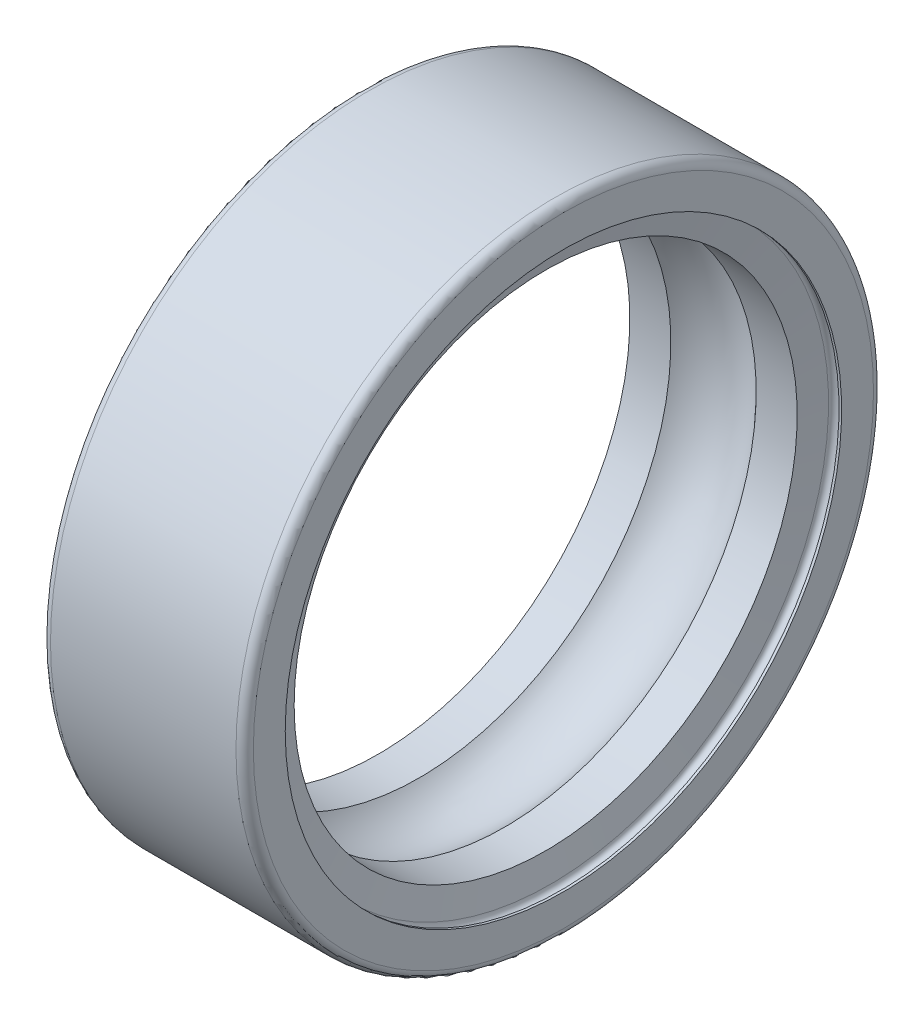
ISO-10303-21;
HEADER;
FILE_DESCRIPTION(('STEP AP214'),'2;1');
FILE_NAME('part.step','',(''),(''),'','','');
FILE_SCHEMA(('AUTOMOTIVE_DESIGN { 1 0 10303 214 1 1 1 1 }'));
ENDSEC;
DATA;
#1=APPLICATION_CONTEXT('core data for automotive mechanical design processes');
#2=APPLICATION_PROTOCOL_DEFINITION('international standard','automotive_design',2000,#1);
#3=PRODUCT_CONTEXT('',#1,'mechanical');
#4=PRODUCT('Part','Part','',(#3));
#5=PRODUCT_RELATED_PRODUCT_CATEGORY('part','',(#4));
#6=PRODUCT_DEFINITION_FORMATION('','',#4);
#7=PRODUCT_DEFINITION_CONTEXT('part definition',#1,'design');
#8=PRODUCT_DEFINITION('design','',#6,#7);
#9=PRODUCT_DEFINITION_SHAPE('','',#8);
#10=(LENGTH_UNIT() NAMED_UNIT(*) SI_UNIT(.MILLI.,.METRE.));
#11=(NAMED_UNIT(*) PLANE_ANGLE_UNIT() SI_UNIT($,.RADIAN.));
#12=(NAMED_UNIT(*) SI_UNIT($,.STERADIAN.) SOLID_ANGLE_UNIT());
#13=UNCERTAINTY_MEASURE_WITH_UNIT(LENGTH_MEASURE(1.E-05),#10,'distance_accuracy_value','');
#14=(GEOMETRIC_REPRESENTATION_CONTEXT(3) GLOBAL_UNCERTAINTY_ASSIGNED_CONTEXT((#13)) GLOBAL_UNIT_ASSIGNED_CONTEXT((#10,
#11,#12)) REPRESENTATION_CONTEXT('',''));
#15=CARTESIAN_POINT('',(0.,0.,0.));
#16=DIRECTION('',(0.,0.,1.));
#17=DIRECTION('',(1.,0.,0.));
#18=AXIS2_PLACEMENT_3D('',#15,#16,#17);
#19=CARTESIAN_POINT('',(0.,10.7,0.));
#20=DIRECTION('',(1.,0.,0.));
#21=DIRECTION('',(0.,0.,-1.));
#22=AXIS2_PLACEMENT_3D('',#19,#20,#21);
#23=PLANE('',#22);
#24=CARTESIAN_POINT('',(0.,0.,0.));
#25=DIRECTION('',(-1.,0.,0.));
#26=DIRECTION('',(0.,0.,1.));
#27=AXIS2_PLACEMENT_3D('',#24,#25,#26);
#28=CIRCLE('',#27,9.6);
#29=CARTESIAN_POINT('',(0.,0.,9.6));
#30=VERTEX_POINT('',#29);
#31=EDGE_CURVE('E77',#30,#30,#28,.T.);
#32=ORIENTED_EDGE('',*,*,#31,.F.);
#33=EDGE_LOOP('',(#32));
#34=FACE_BOUND('',#33,.T.);
#35=CARTESIAN_POINT('',(0.,0.,0.));
#36=DIRECTION('',(-1.,0.,0.));
#37=DIRECTION('',(0.,0.,1.));
#38=AXIS2_PLACEMENT_3D('',#35,#36,#37);
#39=CIRCLE('',#38,10.7);
#40=CARTESIAN_POINT('',(0.,0.,10.7));
#41=VERTEX_POINT('',#40);
#42=EDGE_CURVE('E10',#41,#41,#39,.T.);
#43=ORIENTED_EDGE('',*,*,#42,.T.);
#44=EDGE_LOOP('',(#43));
#45=FACE_BOUND('',#44,.T.);
#46=ADVANCED_FACE('F31',(#34,#45),#23,.F.);
#47=CARTESIAN_POINT('',(0.299999999999937,0.,0.));
#48=DIRECTION('',(-1.,0.,0.));
#49=DIRECTION('',(0.,0.,1.));
#50=AXIS2_PLACEMENT_3D('',#47,#48,#49);
#51=TOROIDAL_SURFACE('',#50,10.7000000000001,0.299999999999937);
#52=ORIENTED_EDGE('',*,*,#42,.F.);
#53=EDGE_LOOP('',(#52));
#54=FACE_BOUND('',#53,.T.);
#55=CARTESIAN_POINT('',(0.300000000000002,0.,0.));
#56=DIRECTION('',(-1.,0.,0.));
#57=DIRECTION('',(0.,0.,1.));
#58=AXIS2_PLACEMENT_3D('',#55,#56,#57);
#59=CIRCLE('',#58,11.);
#60=CARTESIAN_POINT('',(0.300000000000002,0.,11.));
#61=VERTEX_POINT('',#60);
#62=EDGE_CURVE('E37',#61,#61,#59,.T.);
#63=ORIENTED_EDGE('',*,*,#62,.T.);
#64=EDGE_LOOP('',(#63));
#65=FACE_BOUND('',#64,.T.);
#66=ADVANCED_FACE('F84',(#54,#65),#51,.T.);
#67=CARTESIAN_POINT('',(50.,0.,0.));
#68=DIRECTION('',(-1.,0.,0.));
#69=DIRECTION('',(0.,0.,1.));
#70=AXIS2_PLACEMENT_3D('',#67,#68,#69);
#71=CYLINDRICAL_SURFACE('',#70,11.);
#72=ORIENTED_EDGE('',*,*,#62,.F.);
#73=EDGE_LOOP('',(#72));
#74=FACE_BOUND('',#73,.T.);
#75=CARTESIAN_POINT('',(6.7,0.,0.));
#76=DIRECTION('',(-1.,0.,0.));
#77=DIRECTION('',(0.,0.,1.));
#78=AXIS2_PLACEMENT_3D('',#75,#76,#77);
#79=CIRCLE('',#78,11.);
#80=CARTESIAN_POINT('',(6.7,0.,11.));
#81=VERTEX_POINT('',#80);
#82=EDGE_CURVE('E41',#81,#81,#79,.T.);
#83=ORIENTED_EDGE('',*,*,#82,.T.);
#84=EDGE_LOOP('',(#83));
#85=FACE_BOUND('',#84,.T.);
#86=ADVANCED_FACE('F88',(#74,#85),#71,.T.);
#87=CARTESIAN_POINT('',(6.70000000000012,0.,0.));
#88=DIRECTION('',(-1.,0.,0.));
#89=DIRECTION('',(0.,0.,1.));
#90=AXIS2_PLACEMENT_3D('',#87,#88,#89);
#91=TOROIDAL_SURFACE('',#90,10.7000000000001,0.299999999999876);
#92=ORIENTED_EDGE('',*,*,#82,.F.);
#93=EDGE_LOOP('',(#92));
#94=FACE_BOUND('',#93,.T.);
#95=CARTESIAN_POINT('',(7.,0.,0.));
#96=DIRECTION('',(-1.,0.,0.));
#97=DIRECTION('',(0.,0.,1.));
#98=AXIS2_PLACEMENT_3D('',#95,#96,#97);
#99=CIRCLE('',#98,10.7);
#100=CARTESIAN_POINT('',(7.,0.,10.7));
#101=VERTEX_POINT('',#100);
#102=EDGE_CURVE('E45',#101,#101,#99,.T.);
#103=ORIENTED_EDGE('',*,*,#102,.T.);
#104=EDGE_LOOP('',(#103));
#105=FACE_BOUND('',#104,.T.);
#106=ADVANCED_FACE('F93',(#94,#105),#91,.T.);
#107=CARTESIAN_POINT('',(7.,9.6,0.));
#108=DIRECTION('',(-1.,0.,0.));
#109=DIRECTION('',(0.,0.,1.));
#110=AXIS2_PLACEMENT_3D('',#107,#108,#109);
#111=PLANE('',#110);
#112=ORIENTED_EDGE('',*,*,#102,.F.);
#113=EDGE_LOOP('',(#112));
#114=FACE_BOUND('',#113,.T.);
#115=CARTESIAN_POINT('',(7.,0.,0.));
#116=DIRECTION('',(-1.,0.,0.));
#117=DIRECTION('',(0.,0.,1.));
#118=AXIS2_PLACEMENT_3D('',#115,#116,#117);
#119=CIRCLE('',#118,9.6);
#120=CARTESIAN_POINT('',(7.,0.,9.6));
#121=VERTEX_POINT('',#120);
#122=EDGE_CURVE('E50',#121,#121,#119,.T.);
#123=ORIENTED_EDGE('',*,*,#122,.T.);
#124=EDGE_LOOP('',(#123));
#125=FACE_BOUND('',#124,.T.);
#126=ADVANCED_FACE('F99',(#114,#125),#111,.F.);
#127=CARTESIAN_POINT('',(50.,0.,0.));
#128=DIRECTION('',(-1.,0.,0.));
#129=DIRECTION('',(0.,0.,1.));
#130=AXIS2_PLACEMENT_3D('',#127,#128,#129);
#131=CYLINDRICAL_SURFACE('',#130,9.6);
#132=ORIENTED_EDGE('',*,*,#122,.F.);
#133=EDGE_LOOP('',(#132));
#134=FACE_BOUND('',#133,.T.);
#135=CARTESIAN_POINT('',(6.91,0.,0.));
#136=DIRECTION('',(-1.,0.,0.));
#137=DIRECTION('',(0.,0.,1.));
#138=AXIS2_PLACEMENT_3D('',#135,#136,#137);
#139=CIRCLE('',#138,9.6);
#140=CARTESIAN_POINT('',(6.91,0.,9.6));
#141=VERTEX_POINT('',#140);
#142=EDGE_CURVE('E53',#141,#141,#139,.T.);
#143=ORIENTED_EDGE('',*,*,#142,.T.);
#144=EDGE_LOOP('',(#143));
#145=FACE_BOUND('',#144,.T.);
#146=ADVANCED_FACE('F103',(#134,#145),#131,.F.);
#147=CARTESIAN_POINT('',(6.73,0.,0.));
#148=DIRECTION('',(-1.,0.,0.));
#149=DIRECTION('',(0.,0.,1.));
#150=AXIS2_PLACEMENT_3D('',#147,#148,#149);
#151=TOROIDAL_SURFACE('',#150,9.6000000094977,0.18);
#152=ORIENTED_EDGE('',*,*,#142,.F.);
#153=EDGE_LOOP('',(#152));
#154=FACE_BOUND('',#153,.T.);
#155=CARTESIAN_POINT('',(6.55,0.,0.));
#156=DIRECTION('',(-1.,0.,0.));
#157=DIRECTION('',(0.,0.,1.));
#158=AXIS2_PLACEMENT_3D('',#155,#156,#157);
#159=CIRCLE('',#158,9.6);
#160=CARTESIAN_POINT('',(6.55,0.,9.6));
#161=VERTEX_POINT('',#160);
#162=EDGE_CURVE('E56',#161,#161,#159,.T.);
#163=ORIENTED_EDGE('',*,*,#162,.T.);
#164=EDGE_LOOP('',(#163));
#165=FACE_BOUND('',#164,.T.);
#166=ADVANCED_FACE('F107',(#154,#165),#151,.F.);
#167=CARTESIAN_POINT('',(6.3877791777482,0.,0.));
#168=DIRECTION('',(1.,0.,0.));
#169=DIRECTION('',(0.,0.,-1.));
#170=AXIS2_PLACEMENT_3D('',#167,#168,#169);
#171=CONICAL_SURFACE('',#170,8.68,1.39626340159545);
#172=ORIENTED_EDGE('',*,*,#162,.F.);
#173=EDGE_LOOP('',(#172));
#174=FACE_BOUND('',#173,.T.);
#175=CARTESIAN_POINT('',(6.3877791777482,0.,0.));
#176=DIRECTION('',(-1.,0.,0.));
#177=DIRECTION('',(0.,0.,1.));
#178=AXIS2_PLACEMENT_3D('',#175,#176,#177);
#179=CIRCLE('',#178,8.68);
#180=CARTESIAN_POINT('',(6.3877791777482,0.,8.68));
#181=VERTEX_POINT('',#180);
#182=EDGE_CURVE('E59',#181,#181,#179,.T.);
#183=ORIENTED_EDGE('',*,*,#182,.T.);
#184=EDGE_LOOP('',(#183));
#185=FACE_BOUND('',#184,.T.);
#186=ADVANCED_FACE('F111',(#174,#185),#171,.F.);
#187=CARTESIAN_POINT('',(50.,0.,0.));
#188=DIRECTION('',(-1.,0.,0.));
#189=DIRECTION('',(0.,0.,1.));
#190=AXIS2_PLACEMENT_3D('',#187,#188,#189);
#191=CYLINDRICAL_SURFACE('',#190,8.68);
#192=ORIENTED_EDGE('',*,*,#182,.F.);
#193=EDGE_LOOP('',(#192));
#194=FACE_BOUND('',#193,.T.);
#195=CARTESIAN_POINT('',(4.9728680355008,0.,0.));
#196=DIRECTION('',(-1.,0.,0.));
#197=DIRECTION('',(0.,0.,1.));
#198=AXIS2_PLACEMENT_3D('',#195,#196,#197);
#199=CIRCLE('',#198,8.68);
#200=CARTESIAN_POINT('',(4.9728680355008,0.,8.68));
#201=VERTEX_POINT('',#200);
#202=EDGE_CURVE('E62',#201,#201,#199,.T.);
#203=ORIENTED_EDGE('',*,*,#202,.T.);
#204=EDGE_LOOP('',(#203));
#205=FACE_BOUND('',#204,.T.);
#206=ADVANCED_FACE('F115',(#194,#205),#191,.F.);
#207=CARTESIAN_POINT('',(3.5,0.,0.));
#208=DIRECTION('',(-1.,0.,0.));
#209=DIRECTION('',(0.,0.,1.));
#210=AXIS2_PLACEMENT_3D('',#207,#208,#209);
#211=TOROIDAL_SURFACE('',#210,7.35000000000001,1.98449999999999);
#212=ORIENTED_EDGE('',*,*,#202,.F.);
#213=EDGE_LOOP('',(#212));
#214=FACE_BOUND('',#213,.T.);
#215=CARTESIAN_POINT('',(2.0271319644992,0.,0.));
#216=DIRECTION('',(-1.,0.,0.));
#217=DIRECTION('',(0.,0.,1.));
#218=AXIS2_PLACEMENT_3D('',#215,#216,#217);
#219=CIRCLE('',#218,8.68);
#220=CARTESIAN_POINT('',(2.0271319644992,0.,8.68));
#221=VERTEX_POINT('',#220);
#222=EDGE_CURVE('E65',#221,#221,#219,.T.);
#223=ORIENTED_EDGE('',*,*,#222,.T.);
#224=EDGE_LOOP('',(#223));
#225=FACE_BOUND('',#224,.T.);
#226=ADVANCED_FACE('F119',(#214,#225),#211,.F.);
#227=CARTESIAN_POINT('',(50.,0.,0.));
#228=DIRECTION('',(-1.,0.,0.));
#229=DIRECTION('',(0.,0.,1.));
#230=AXIS2_PLACEMENT_3D('',#227,#228,#229);
#231=CYLINDRICAL_SURFACE('',#230,8.68);
#232=ORIENTED_EDGE('',*,*,#222,.F.);
#233=EDGE_LOOP('',(#232));
#234=FACE_BOUND('',#233,.T.);
#235=CARTESIAN_POINT('',(0.612220822251791,0.,0.));
#236=DIRECTION('',(-1.,0.,0.));
#237=DIRECTION('',(0.,0.,1.));
#238=AXIS2_PLACEMENT_3D('',#235,#236,#237);
#239=CIRCLE('',#238,8.68);
#240=CARTESIAN_POINT('',(0.612220822251791,0.,8.68));
#241=VERTEX_POINT('',#240);
#242=EDGE_CURVE('E68',#241,#241,#239,.T.);
#243=ORIENTED_EDGE('',*,*,#242,.T.);
#244=EDGE_LOOP('',(#243));
#245=FACE_BOUND('',#244,.T.);
#246=ADVANCED_FACE('F123',(#234,#245),#231,.F.);
#247=CARTESIAN_POINT('',(0.449999999999999,0.,0.));
#248=DIRECTION('',(-1.,0.,0.));
#249=DIRECTION('',(0.,0.,1.));
#250=AXIS2_PLACEMENT_3D('',#247,#248,#249);
#251=CONICAL_SURFACE('',#250,9.6,1.39626340159546);
#252=ORIENTED_EDGE('',*,*,#242,.F.);
#253=EDGE_LOOP('',(#252));
#254=FACE_BOUND('',#253,.T.);
#255=CARTESIAN_POINT('',(0.449999999999999,0.,0.));
#256=DIRECTION('',(-1.,0.,0.));
#257=DIRECTION('',(0.,0.,1.));
#258=AXIS2_PLACEMENT_3D('',#255,#256,#257);
#259=CIRCLE('',#258,9.6);
#260=CARTESIAN_POINT('',(0.449999999999999,0.,9.6));
#261=VERTEX_POINT('',#260);
#262=EDGE_CURVE('E71',#261,#261,#259,.T.);
#263=ORIENTED_EDGE('',*,*,#262,.T.);
#264=EDGE_LOOP('',(#263));
#265=FACE_BOUND('',#264,.T.);
#266=ADVANCED_FACE('F127',(#254,#265),#251,.F.);
#267=CARTESIAN_POINT('',(0.27,0.,0.));
#268=DIRECTION('',(-1.,0.,0.));
#269=DIRECTION('',(0.,0.,1.));
#270=AXIS2_PLACEMENT_3D('',#267,#268,#269);
#271=TOROIDAL_SURFACE('',#270,9.6,0.18);
#272=ORIENTED_EDGE('',*,*,#262,.F.);
#273=EDGE_LOOP('',(#272));
#274=FACE_BOUND('',#273,.T.);
#275=CARTESIAN_POINT('',(0.0899999999999998,0.,0.));
#276=DIRECTION('',(-1.,0.,0.));
#277=DIRECTION('',(0.,0.,1.));
#278=AXIS2_PLACEMENT_3D('',#275,#276,#277);
#279=CIRCLE('',#278,9.6);
#280=CARTESIAN_POINT('',(0.0899999999999998,0.,9.6));
#281=VERTEX_POINT('',#280);
#282=EDGE_CURVE('E74',#281,#281,#279,.T.);
#283=ORIENTED_EDGE('',*,*,#282,.T.);
#284=EDGE_LOOP('',(#283));
#285=FACE_BOUND('',#284,.T.);
#286=ADVANCED_FACE('F131',(#274,#285),#271,.F.);
#287=CARTESIAN_POINT('',(50.,0.,0.));
#288=DIRECTION('',(-1.,0.,0.));
#289=DIRECTION('',(0.,0.,1.));
#290=AXIS2_PLACEMENT_3D('',#287,#288,#289);
#291=CYLINDRICAL_SURFACE('',#290,9.6);
#292=ORIENTED_EDGE('',*,*,#282,.F.);
#293=EDGE_LOOP('',(#292));
#294=FACE_BOUND('',#293,.T.);
#295=ORIENTED_EDGE('',*,*,#31,.T.);
#296=EDGE_LOOP('',(#295));
#297=FACE_BOUND('',#296,.T.);
#298=ADVANCED_FACE('F81',(#294,#297),#291,.F.);
#299=CLOSED_SHELL('',(#46,#66,#86,#106,#126,#146,#166,#186,#206,#226,#246,#266,#286,#298));
#300=MANIFOLD_SOLID_BREP('B2',#299);
#301=ADVANCED_BREP_SHAPE_REPRESENTATION('',(#18,#300),#14);
#302=SHAPE_DEFINITION_REPRESENTATION(#9,#301);
ENDSEC;
END-ISO-10303-21;
